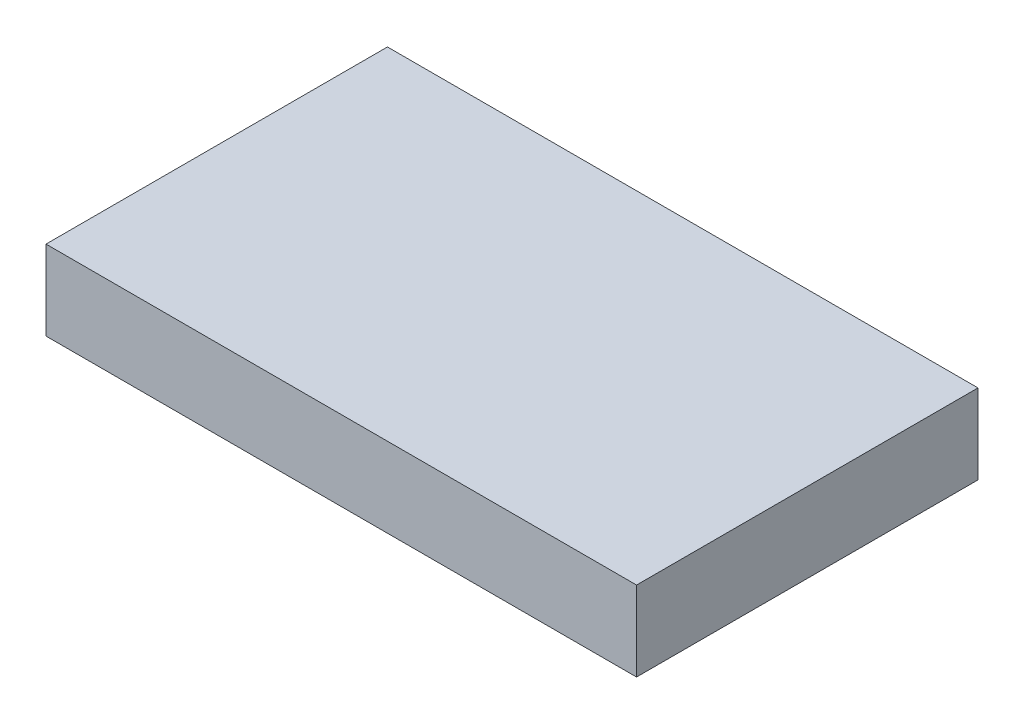
ISO-10303-21;
HEADER;
FILE_DESCRIPTION(('STEP AP214'),'2;1');
FILE_NAME('part.step','',(''),(''),'','','');
FILE_SCHEMA(('AUTOMOTIVE_DESIGN { 1 0 10303 214 1 1 1 1 }'));
ENDSEC;
DATA;
#1=APPLICATION_CONTEXT('core data for automotive mechanical design processes');
#2=APPLICATION_PROTOCOL_DEFINITION('international standard','automotive_design',2000,#1);
#3=PRODUCT_CONTEXT('',#1,'mechanical');
#4=PRODUCT('Part','Part','',(#3));
#5=PRODUCT_RELATED_PRODUCT_CATEGORY('part','',(#4));
#6=PRODUCT_DEFINITION_FORMATION('','',#4);
#7=PRODUCT_DEFINITION_CONTEXT('part definition',#1,'design');
#8=PRODUCT_DEFINITION('design','',#6,#7);
#9=PRODUCT_DEFINITION_SHAPE('','',#8);
#10=(LENGTH_UNIT() NAMED_UNIT(*) SI_UNIT(.MILLI.,.METRE.));
#11=(NAMED_UNIT(*) PLANE_ANGLE_UNIT() SI_UNIT($,.RADIAN.));
#12=(NAMED_UNIT(*) SI_UNIT($,.STERADIAN.) SOLID_ANGLE_UNIT());
#13=UNCERTAINTY_MEASURE_WITH_UNIT(LENGTH_MEASURE(1.E-05),#10,'distance_accuracy_value','');
#14=(GEOMETRIC_REPRESENTATION_CONTEXT(3) GLOBAL_UNCERTAINTY_ASSIGNED_CONTEXT((#13)) GLOBAL_UNIT_ASSIGNED_CONTEXT((#10,
#11,#12)) REPRESENTATION_CONTEXT('',''));
#15=CARTESIAN_POINT('',(0.,0.,0.));
#16=DIRECTION('',(0.,0.,1.));
#17=DIRECTION('',(1.,0.,0.));
#18=AXIS2_PLACEMENT_3D('',#15,#16,#17);
#19=CARTESIAN_POINT('',(-31.3963096171026,10.9,7.03623713601979));
#20=DIRECTION('',(1.,0.,0.));
#21=DIRECTION('',(0.,0.,-1.));
#22=AXIS2_PLACEMENT_3D('',#19,#20,#21);
#23=PLANE('',#22);
#24=DIRECTION('',(0.,0.,1.));
#25=VECTOR('',#24,1.);
#26=CARTESIAN_POINT('',(-31.3963096171026,0.,7.03623713601979));
#27=LINE('',#26,#25);
#28=CARTESIAN_POINT('',(-31.3963096171026,0.,7.03623713601979));
#29=VERTEX_POINT('',#28);
#30=CARTESIAN_POINT('',(-31.3963096171026,0.,53.7362371360198));
#31=VERTEX_POINT('',#30);
#32=EDGE_CURVE('E96',#29,#31,#27,.T.);
#33=ORIENTED_EDGE('',*,*,#32,.T.);
#34=DIRECTION('',(0.,-1.,0.));
#35=VECTOR('',#34,1.);
#36=CARTESIAN_POINT('',(-31.3963096171026,10.9,53.7362371360198));
#37=LINE('',#36,#35);
#38=CARTESIAN_POINT('',(-31.3963096171026,10.9,53.7362371360198));
#39=VERTEX_POINT('',#38);
#40=EDGE_CURVE('E11',#39,#31,#37,.T.);
#41=ORIENTED_EDGE('',*,*,#40,.F.);
#42=DIRECTION('',(0.,0.,1.));
#43=VECTOR('',#42,1.);
#44=CARTESIAN_POINT('',(-31.3963096171026,10.9,7.03623713601979));
#45=LINE('',#44,#43);
#46=CARTESIAN_POINT('',(-31.3963096171026,10.9,7.03623713601979));
#47=VERTEX_POINT('',#46);
#48=EDGE_CURVE('E84',#47,#39,#45,.T.);
#49=ORIENTED_EDGE('',*,*,#48,.F.);
#50=DIRECTION('',(0.,-1.,0.));
#51=VECTOR('',#50,1.);
#52=CARTESIAN_POINT('',(-31.3963096171026,10.9,7.03623713601979));
#53=LINE('',#52,#51);
#54=EDGE_CURVE('E92',#47,#29,#53,.T.);
#55=ORIENTED_EDGE('',*,*,#54,.T.);
#56=EDGE_LOOP('',(#33,#41,#49,#55));
#57=FACE_BOUND('',#56,.T.);
#58=ADVANCED_FACE('F33',(#57),#23,.F.);
#59=CARTESIAN_POINT('',(-31.3963096171026,10.9,53.7362371360198));
#60=DIRECTION('',(0.,0.,-1.));
#61=DIRECTION('',(-1.,0.,0.));
#62=AXIS2_PLACEMENT_3D('',#59,#60,#61);
#63=PLANE('',#62);
#64=DIRECTION('',(1.,0.,0.));
#65=VECTOR('',#64,1.);
#66=CARTESIAN_POINT('',(-31.3963096171026,0.,53.7362371360198));
#67=LINE('',#66,#65);
#68=CARTESIAN_POINT('',(49.3756903828974,0.,53.7362371360198));
#69=VERTEX_POINT('',#68);
#70=EDGE_CURVE('E88',#31,#69,#67,.T.);
#71=ORIENTED_EDGE('',*,*,#70,.T.);
#72=DIRECTION('',(0.,-1.,0.));
#73=VECTOR('',#72,1.);
#74=CARTESIAN_POINT('',(49.3756903828974,10.9,53.7362371360198));
#75=LINE('',#74,#73);
#76=CARTESIAN_POINT('',(49.3756903828974,10.9,53.7362371360198));
#77=VERTEX_POINT('',#76);
#78=EDGE_CURVE('E41',#77,#69,#75,.T.);
#79=ORIENTED_EDGE('',*,*,#78,.F.);
#80=DIRECTION('',(1.,0.,0.));
#81=VECTOR('',#80,1.);
#82=CARTESIAN_POINT('',(-31.3963096171026,10.9,53.7362371360198));
#83=LINE('',#82,#81);
#84=EDGE_CURVE('E79',#39,#77,#83,.T.);
#85=ORIENTED_EDGE('',*,*,#84,.F.);
#86=ORIENTED_EDGE('',*,*,#40,.T.);
#87=EDGE_LOOP('',(#71,#79,#85,#86));
#88=FACE_BOUND('',#87,.T.);
#89=ADVANCED_FACE('F87',(#88),#63,.F.);
#90=CARTESIAN_POINT('',(49.3756903828974,10.9,7.03623713601979));
#91=DIRECTION('',(-1.,0.,0.));
#92=DIRECTION('',(0.,0.,1.));
#93=AXIS2_PLACEMENT_3D('',#90,#91,#92);
#94=PLANE('',#93);
#95=DIRECTION('',(0.,0.,-1.));
#96=VECTOR('',#95,1.);
#97=CARTESIAN_POINT('',(49.3756903828974,0.,7.03623713601979));
#98=LINE('',#97,#96);
#99=CARTESIAN_POINT('',(49.3756903828974,0.,7.03623713601979));
#100=VERTEX_POINT('',#99);
#101=EDGE_CURVE('E66',#69,#100,#98,.T.);
#102=ORIENTED_EDGE('',*,*,#101,.T.);
#103=DIRECTION('',(0.,-1.,0.));
#104=VECTOR('',#103,1.);
#105=CARTESIAN_POINT('',(49.3756903828974,10.9,7.03623713601979));
#106=LINE('',#105,#104);
#107=CARTESIAN_POINT('',(49.3756903828974,10.9,7.03623713601979));
#108=VERTEX_POINT('',#107);
#109=EDGE_CURVE('E89',#108,#100,#106,.T.);
#110=ORIENTED_EDGE('',*,*,#109,.F.);
#111=DIRECTION('',(0.,0.,-1.));
#112=VECTOR('',#111,1.);
#113=CARTESIAN_POINT('',(49.3756903828974,10.9,7.03623713601979));
#114=LINE('',#113,#112);
#115=EDGE_CURVE('E82',#77,#108,#114,.T.);
#116=ORIENTED_EDGE('',*,*,#115,.F.);
#117=ORIENTED_EDGE('',*,*,#78,.T.);
#118=EDGE_LOOP('',(#102,#110,#116,#117));
#119=FACE_BOUND('',#118,.T.);
#120=ADVANCED_FACE('F90',(#119),#94,.F.);
#121=CARTESIAN_POINT('',(-31.3963096171026,10.9,7.03623713601979));
#122=DIRECTION('',(0.,0.,1.));
#123=DIRECTION('',(1.,0.,0.));
#124=AXIS2_PLACEMENT_3D('',#121,#122,#123);
#125=PLANE('',#124);
#126=DIRECTION('',(-1.,0.,0.));
#127=VECTOR('',#126,1.);
#128=CARTESIAN_POINT('',(-31.3963096171026,0.,7.03623713601979));
#129=LINE('',#128,#127);
#130=EDGE_CURVE('E72',#100,#29,#129,.T.);
#131=ORIENTED_EDGE('',*,*,#130,.T.);
#132=ORIENTED_EDGE('',*,*,#54,.F.);
#133=DIRECTION('',(-1.,0.,0.));
#134=VECTOR('',#133,1.);
#135=CARTESIAN_POINT('',(-31.3963096171026,10.9,7.03623713601979));
#136=LINE('',#135,#134);
#137=EDGE_CURVE('E49',#108,#47,#136,.T.);
#138=ORIENTED_EDGE('',*,*,#137,.F.);
#139=ORIENTED_EDGE('',*,*,#109,.T.);
#140=EDGE_LOOP('',(#131,#132,#138,#139));
#141=FACE_BOUND('',#140,.T.);
#142=ADVANCED_FACE('F103',(#141),#125,.F.);
#143=CARTESIAN_POINT('',(0.,10.9,0.));
#144=DIRECTION('',(0.,1.,0.));
#145=DIRECTION('',(0.,0.,1.));
#146=AXIS2_PLACEMENT_3D('',#143,#144,#145);
#147=PLANE('',#146);
#148=ORIENTED_EDGE('',*,*,#48,.T.);
#149=ORIENTED_EDGE('',*,*,#84,.T.);
#150=ORIENTED_EDGE('',*,*,#115,.T.);
#151=ORIENTED_EDGE('',*,*,#137,.T.);
#152=EDGE_LOOP('',(#148,#149,#150,#151));
#153=FACE_BOUND('',#152,.T.);
#154=ADVANCED_FACE('F80',(#153),#147,.T.);
#155=CARTESIAN_POINT('',(0.,0.,0.));
#156=DIRECTION('',(0.,1.,0.));
#157=DIRECTION('',(0.,0.,1.));
#158=AXIS2_PLACEMENT_3D('',#155,#156,#157);
#159=PLANE('',#158);
#160=ORIENTED_EDGE('',*,*,#32,.F.);
#161=ORIENTED_EDGE('',*,*,#130,.F.);
#162=ORIENTED_EDGE('',*,*,#101,.F.);
#163=ORIENTED_EDGE('',*,*,#70,.F.);
#164=EDGE_LOOP('',(#160,#161,#162,#163));
#165=FACE_BOUND('',#164,.T.);
#166=ADVANCED_FACE('F106',(#165),#159,.F.);
#167=CLOSED_SHELL('',(#58,#89,#120,#142,#154,#166));
#168=MANIFOLD_SOLID_BREP('B2',#167);
#169=ADVANCED_BREP_SHAPE_REPRESENTATION('',(#18,#168),#14);
#170=SHAPE_DEFINITION_REPRESENTATION(#9,#169);
ENDSEC;
END-ISO-10303-21;
